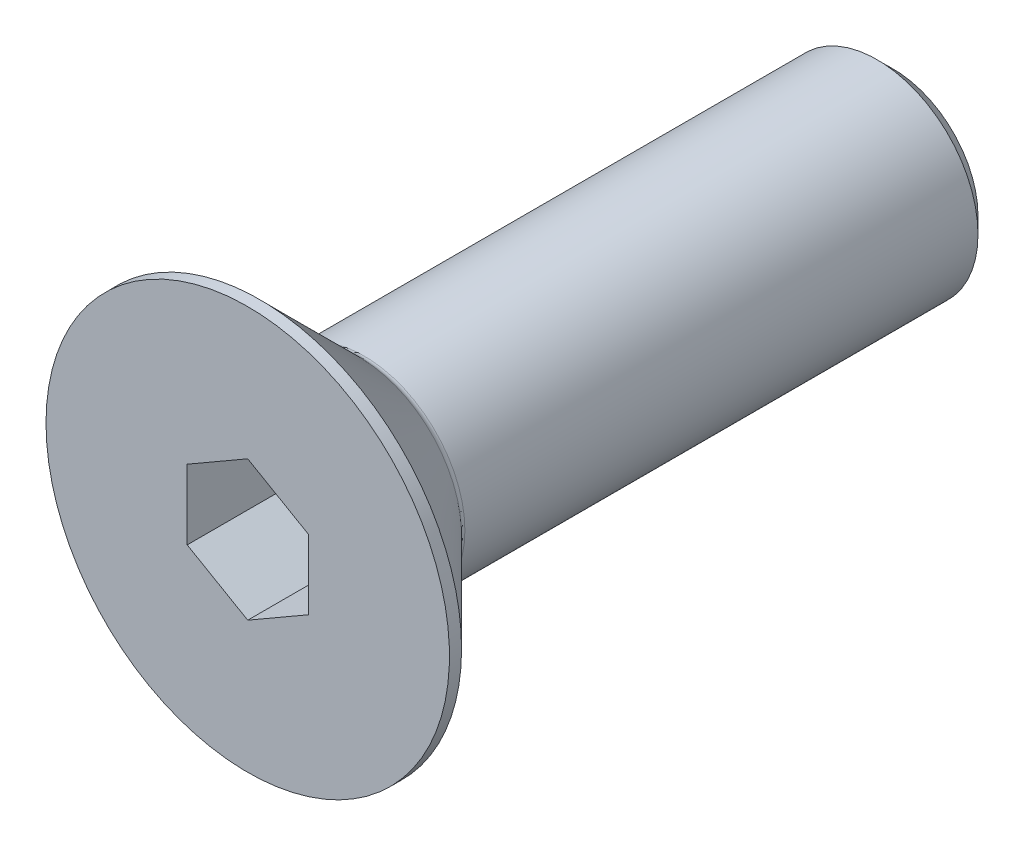
ISO-10303-21;
HEADER;
FILE_DESCRIPTION(('STEP AP214'),'2;1');
FILE_NAME('part.step','',(''),(''),'','','');
FILE_SCHEMA(('AUTOMOTIVE_DESIGN { 1 0 10303 214 1 1 1 1 }'));
ENDSEC;
DATA;
#1=APPLICATION_CONTEXT('core data for automotive mechanical design processes');
#2=APPLICATION_PROTOCOL_DEFINITION('international standard','automotive_design',2000,#1);
#3=PRODUCT_CONTEXT('',#1,'mechanical');
#4=PRODUCT('Part','Part','',(#3));
#5=PRODUCT_RELATED_PRODUCT_CATEGORY('part','',(#4));
#6=PRODUCT_DEFINITION_FORMATION('','',#4);
#7=PRODUCT_DEFINITION_CONTEXT('part definition',#1,'design');
#8=PRODUCT_DEFINITION('design','',#6,#7);
#9=PRODUCT_DEFINITION_SHAPE('','',#8);
#10=(LENGTH_UNIT() NAMED_UNIT(*) SI_UNIT(.MILLI.,.METRE.));
#11=(NAMED_UNIT(*) PLANE_ANGLE_UNIT() SI_UNIT($,.RADIAN.));
#12=(NAMED_UNIT(*) SI_UNIT($,.STERADIAN.) SOLID_ANGLE_UNIT());
#13=UNCERTAINTY_MEASURE_WITH_UNIT(LENGTH_MEASURE(1.E-05),#10,'distance_accuracy_value','');
#14=(GEOMETRIC_REPRESENTATION_CONTEXT(3) GLOBAL_UNCERTAINTY_ASSIGNED_CONTEXT((#13)) GLOBAL_UNIT_ASSIGNED_CONTEXT((#10,
#11,#12)) REPRESENTATION_CONTEXT('',''));
#15=CARTESIAN_POINT('',(0.,0.,0.));
#16=DIRECTION('',(0.,0.,1.));
#17=DIRECTION('',(1.,0.,0.));
#18=AXIS2_PLACEMENT_3D('',#15,#16,#17);
#19=CARTESIAN_POINT('',(0.,1.73205080756888,0.));
#20=DIRECTION('',(-0.5,0.866025403784439,0.));
#21=DIRECTION('',(-0.866025403784439,-0.5,0.));
#22=AXIS2_PLACEMENT_3D('',#19,#20,#21);
#23=PLANE('',#22);
#24=DIRECTION('',(0.,0.,1.));
#25=VECTOR('',#24,1.);
#26=CARTESIAN_POINT('',(0.,1.73205080756888,0.));
#27=LINE('',#26,#25);
#28=CARTESIAN_POINT('',(0.,1.73205080756888,-2.3));
#29=VERTEX_POINT('',#28);
#30=CARTESIAN_POINT('',(0.,1.73205080756888,0.));
#31=VERTEX_POINT('',#30);
#32=EDGE_CURVE('E81',#29,#31,#27,.T.);
#33=ORIENTED_EDGE('',*,*,#32,.T.);
#34=DIRECTION('',(-0.866025403784439,-0.5,0.));
#35=VECTOR('',#34,1.);
#36=CARTESIAN_POINT('',(0.,1.73205080756888,0.));
#37=LINE('',#36,#35);
#38=CARTESIAN_POINT('',(-1.5,0.866025403784439,0.));
#39=VERTEX_POINT('',#38);
#40=EDGE_CURVE('E70',#39,#31,#37,.F.);
#41=ORIENTED_EDGE('',*,*,#40,.F.);
#42=DIRECTION('',(0.,0.,1.));
#43=VECTOR('',#42,1.);
#44=CARTESIAN_POINT('',(-1.5,0.866025403784439,0.));
#45=LINE('',#44,#43);
#46=CARTESIAN_POINT('',(-1.5,0.866025403784439,-2.3));
#47=VERTEX_POINT('',#46);
#48=EDGE_CURVE('E137',#39,#47,#45,.F.);
#49=ORIENTED_EDGE('',*,*,#48,.T.);
#50=DIRECTION('',(-0.866025403784439,-0.5,0.));
#51=VECTOR('',#50,1.);
#52=CARTESIAN_POINT('',(0.,1.73205080756888,-2.3));
#53=LINE('',#52,#51);
#54=EDGE_CURVE('E66',#29,#47,#53,.T.);
#55=ORIENTED_EDGE('',*,*,#54,.F.);
#56=EDGE_LOOP('',(#33,#41,#49,#55));
#57=FACE_BOUND('',#56,.T.);
#58=ADVANCED_FACE('F15',(#57),#23,.F.);
#59=CARTESIAN_POINT('',(1.5,0.86602540378444,0.));
#60=DIRECTION('',(0.499999999999999,0.866025403784439,0.));
#61=DIRECTION('',(-0.866025403784439,0.499999999999999,0.));
#62=AXIS2_PLACEMENT_3D('',#59,#60,#61);
#63=PLANE('',#62);
#64=DIRECTION('',(0.,0.,-1.));
#65=VECTOR('',#64,1.);
#66=CARTESIAN_POINT('',(1.5,0.86602540378444,0.));
#67=LINE('',#66,#65);
#68=CARTESIAN_POINT('',(1.5,0.86602540378444,-2.3));
#69=VERTEX_POINT('',#68);
#70=CARTESIAN_POINT('',(1.5,0.86602540378444,0.));
#71=VERTEX_POINT('',#70);
#72=EDGE_CURVE('E86',#69,#71,#67,.F.);
#73=ORIENTED_EDGE('',*,*,#72,.T.);
#74=DIRECTION('',(-0.866025403784439,0.499999999999999,0.));
#75=VECTOR('',#74,1.);
#76=CARTESIAN_POINT('',(1.5,0.86602540378444,0.));
#77=LINE('',#76,#75);
#78=EDGE_CURVE('E74',#31,#71,#77,.F.);
#79=ORIENTED_EDGE('',*,*,#78,.F.);
#80=ORIENTED_EDGE('',*,*,#32,.F.);
#81=DIRECTION('',(-0.866025403784439,0.499999999999999,0.));
#82=VECTOR('',#81,1.);
#83=CARTESIAN_POINT('',(1.5,0.86602540378444,-2.3));
#84=LINE('',#83,#82);
#85=EDGE_CURVE('E87',#69,#29,#84,.T.);
#86=ORIENTED_EDGE('',*,*,#85,.F.);
#87=EDGE_LOOP('',(#73,#79,#80,#86));
#88=FACE_BOUND('',#87,.T.);
#89=ADVANCED_FACE('F84',(#88),#63,.F.);
#90=CARTESIAN_POINT('',(-1.5,0.866025403784439,0.));
#91=DIRECTION('',(-1.,0.,0.));
#92=DIRECTION('',(0.,0.,1.));
#93=AXIS2_PLACEMENT_3D('',#90,#91,#92);
#94=PLANE('',#93);
#95=ORIENTED_EDGE('',*,*,#48,.F.);
#96=DIRECTION('',(0.,1.,0.));
#97=VECTOR('',#96,1.);
#98=CARTESIAN_POINT('',(-1.5,0.866025403784439,0.));
#99=LINE('',#98,#97);
#100=CARTESIAN_POINT('',(-1.5,-0.866025403784439,0.));
#101=VERTEX_POINT('',#100);
#102=EDGE_CURVE('E77',#101,#39,#99,.T.);
#103=ORIENTED_EDGE('',*,*,#102,.F.);
#104=DIRECTION('',(0.,0.,1.));
#105=VECTOR('',#104,1.);
#106=CARTESIAN_POINT('',(-1.5,-0.866025403784439,0.));
#107=LINE('',#106,#105);
#108=CARTESIAN_POINT('',(-1.5,-0.866025403784439,-2.3));
#109=VERTEX_POINT('',#108);
#110=EDGE_CURVE('E128',#101,#109,#107,.F.);
#111=ORIENTED_EDGE('',*,*,#110,.T.);
#112=DIRECTION('',(0.,1.,0.));
#113=VECTOR('',#112,1.);
#114=CARTESIAN_POINT('',(-1.5,0.866025403784439,-2.3));
#115=LINE('',#114,#113);
#116=EDGE_CURVE('E135',#47,#109,#115,.F.);
#117=ORIENTED_EDGE('',*,*,#116,.F.);
#118=EDGE_LOOP('',(#95,#103,#111,#117));
#119=FACE_BOUND('',#118,.T.);
#120=ADVANCED_FACE('F140',(#119),#94,.F.);
#121=CARTESIAN_POINT('',(1.5,-0.866025403784439,0.));
#122=DIRECTION('',(1.,0.,0.));
#123=DIRECTION('',(0.,0.,-1.));
#124=AXIS2_PLACEMENT_3D('',#121,#122,#123);
#125=PLANE('',#124);
#126=DIRECTION('',(0.,0.,1.));
#127=VECTOR('',#126,1.);
#128=CARTESIAN_POINT('',(1.5,-0.866025403784439,0.));
#129=LINE('',#128,#127);
#130=CARTESIAN_POINT('',(1.5,-0.866025403784439,-2.3));
#131=VERTEX_POINT('',#130);
#132=CARTESIAN_POINT('',(1.5,-0.866025403784439,0.));
#133=VERTEX_POINT('',#132);
#134=EDGE_CURVE('E120',#131,#133,#129,.T.);
#135=ORIENTED_EDGE('',*,*,#134,.T.);
#136=DIRECTION('',(0.,1.,0.));
#137=VECTOR('',#136,1.);
#138=CARTESIAN_POINT('',(1.5,-0.866025403784439,0.));
#139=LINE('',#138,#137);
#140=EDGE_CURVE('E34',#71,#133,#139,.F.);
#141=ORIENTED_EDGE('',*,*,#140,.F.);
#142=ORIENTED_EDGE('',*,*,#72,.F.);
#143=DIRECTION('',(0.,1.,0.));
#144=VECTOR('',#143,1.);
#145=CARTESIAN_POINT('',(1.5,0.,-2.3));
#146=LINE('',#145,#144);
#147=EDGE_CURVE('E122',#131,#69,#146,.T.);
#148=ORIENTED_EDGE('',*,*,#147,.F.);
#149=EDGE_LOOP('',(#135,#141,#142,#148));
#150=FACE_BOUND('',#149,.T.);
#151=ADVANCED_FACE('F147',(#150),#125,.F.);
#152=CARTESIAN_POINT('',(-1.5,-0.866025403784439,0.));
#153=DIRECTION('',(-0.499999999999999,-0.866025403784439,0.));
#154=DIRECTION('',(0.866025403784439,-0.499999999999999,0.));
#155=AXIS2_PLACEMENT_3D('',#152,#153,#154);
#156=PLANE('',#155);
#157=ORIENTED_EDGE('',*,*,#110,.F.);
#158=DIRECTION('',(0.866025403784439,-0.499999999999999,0.));
#159=VECTOR('',#158,1.);
#160=CARTESIAN_POINT('',(-1.5,-0.866025403784439,0.));
#161=LINE('',#160,#159);
#162=CARTESIAN_POINT('',(0.,-1.73205080756888,0.));
#163=VERTEX_POINT('',#162);
#164=EDGE_CURVE('E131',#163,#101,#161,.F.);
#165=ORIENTED_EDGE('',*,*,#164,.F.);
#166=DIRECTION('',(0.,0.,1.));
#167=VECTOR('',#166,1.);
#168=CARTESIAN_POINT('',(0.,-1.73205080756888,0.));
#169=LINE('',#168,#167);
#170=CARTESIAN_POINT('',(0.,-1.73205080756888,-2.3));
#171=VERTEX_POINT('',#170);
#172=EDGE_CURVE('E118',#163,#171,#169,.F.);
#173=ORIENTED_EDGE('',*,*,#172,.T.);
#174=DIRECTION('',(0.866025403784439,-0.5,0.));
#175=VECTOR('',#174,1.);
#176=CARTESIAN_POINT('',(-1.5,-0.866025403784439,-2.3));
#177=LINE('',#176,#175);
#178=EDGE_CURVE('E125',#109,#171,#177,.T.);
#179=ORIENTED_EDGE('',*,*,#178,.F.);
#180=EDGE_LOOP('',(#157,#165,#173,#179));
#181=FACE_BOUND('',#180,.T.);
#182=ADVANCED_FACE('F154',(#181),#156,.F.);
#183=CARTESIAN_POINT('',(0.,0.,-2.3));
#184=DIRECTION('',(0.,0.,1.));
#185=DIRECTION('',(1.,0.,0.));
#186=AXIS2_PLACEMENT_3D('',#183,#184,#185);
#187=PLANE('',#186);
#188=ORIENTED_EDGE('',*,*,#54,.T.);
#189=ORIENTED_EDGE('',*,*,#116,.T.);
#190=ORIENTED_EDGE('',*,*,#178,.T.);
#191=DIRECTION('',(0.866025403784439,0.5,0.));
#192=VECTOR('',#191,1.);
#193=CARTESIAN_POINT('',(0.,-1.73205080756888,-2.3));
#194=LINE('',#193,#192);
#195=EDGE_CURVE('E115',#171,#131,#194,.T.);
#196=ORIENTED_EDGE('',*,*,#195,.T.);
#197=ORIENTED_EDGE('',*,*,#147,.T.);
#198=ORIENTED_EDGE('',*,*,#85,.T.);
#199=EDGE_LOOP('',(#188,#189,#190,#196,#197,#198));
#200=FACE_BOUND('',#199,.T.);
#201=ADVANCED_FACE('F144',(#200),#187,.T.);
#202=CARTESIAN_POINT('',(0.,-1.73205080756888,0.));
#203=DIRECTION('',(0.5,-0.866025403784439,0.));
#204=DIRECTION('',(0.866025403784439,0.5,0.));
#205=AXIS2_PLACEMENT_3D('',#202,#203,#204);
#206=PLANE('',#205);
#207=ORIENTED_EDGE('',*,*,#172,.F.);
#208=DIRECTION('',(-0.866025403784439,-0.5,0.));
#209=VECTOR('',#208,1.);
#210=CARTESIAN_POINT('',(1.5,-0.866025403784439,0.));
#211=LINE('',#210,#209);
#212=EDGE_CURVE('E113',#133,#163,#211,.T.);
#213=ORIENTED_EDGE('',*,*,#212,.F.);
#214=ORIENTED_EDGE('',*,*,#134,.F.);
#215=ORIENTED_EDGE('',*,*,#195,.F.);
#216=EDGE_LOOP('',(#207,#213,#214,#215));
#217=FACE_BOUND('',#216,.T.);
#218=ADVANCED_FACE('F152',(#217),#206,.F.);
#219=CARTESIAN_POINT('',(2.5,0.,0.));
#220=DIRECTION('',(0.,0.,1.));
#221=DIRECTION('',(1.,0.,0.));
#222=AXIS2_PLACEMENT_3D('',#219,#220,#221);
#223=PLANE('',#222);
#224=ORIENTED_EDGE('',*,*,#140,.T.);
#225=ORIENTED_EDGE('',*,*,#212,.T.);
#226=ORIENTED_EDGE('',*,*,#164,.T.);
#227=ORIENTED_EDGE('',*,*,#102,.T.);
#228=ORIENTED_EDGE('',*,*,#40,.T.);
#229=ORIENTED_EDGE('',*,*,#78,.T.);
#230=EDGE_LOOP('',(#224,#225,#226,#227,#228,#229));
#231=FACE_BOUND('',#230,.T.);
#232=CARTESIAN_POINT('',(0.,0.,0.));
#233=DIRECTION('',(0.,0.,-1.));
#234=DIRECTION('',(-1.,0.,0.));
#235=AXIS2_PLACEMENT_3D('',#232,#233,#234);
#236=CIRCLE('',#235,5.);
#237=CARTESIAN_POINT('',(-5.,0.,0.));
#238=VERTEX_POINT('',#237);
#239=EDGE_CURVE('E19',#238,#238,#236,.T.);
#240=ORIENTED_EDGE('',*,*,#239,.F.);
#241=EDGE_LOOP('',(#240));
#242=FACE_BOUND('',#241,.T.);
#243=ADVANCED_FACE('F71',(#231,#242),#223,.T.);
#244=CARTESIAN_POINT('',(0.,0.,-0.150000000000001));
#245=DIRECTION('',(0.,0.,-1.));
#246=DIRECTION('',(-1.,0.,0.));
#247=AXIS2_PLACEMENT_3D('',#244,#245,#246);
#248=CYLINDRICAL_SURFACE('',#247,5.);
#249=ORIENTED_EDGE('',*,*,#239,.T.);
#250=EDGE_LOOP('',(#249));
#251=FACE_BOUND('',#250,.T.);
#252=CARTESIAN_POINT('',(0.,0.,-0.299999998844669));
#253=DIRECTION('',(0.,0.,1.));
#254=DIRECTION('',(1.,0.,0.));
#255=AXIS2_PLACEMENT_3D('',#252,#253,#254);
#256=CIRCLE('',#255,4.99999999891543);
#257=CARTESIAN_POINT('',(4.99999999891543,0.,-0.299999998844669));
#258=VERTEX_POINT('',#257);
#259=EDGE_CURVE('E100',#258,#258,#256,.F.);
#260=ORIENTED_EDGE('',*,*,#259,.F.);
#261=EDGE_LOOP('',(#260));
#262=FACE_BOUND('',#261,.T.);
#263=ADVANCED_FACE('F183',(#251,#262),#248,.T.);
#264=CARTESIAN_POINT('',(0.,0.,-0.299999998844669));
#265=DIRECTION('',(0.,0.,1.));
#266=DIRECTION('',(1.,0.,0.));
#267=AXIS2_PLACEMENT_3D('',#264,#265,#266);
#268=CONICAL_SURFACE('',#267,4.99999999891543,0.785398162501056);
#269=CARTESIAN_POINT('',(0.,0.,-2.74142135623731));
#270=DIRECTION('',(0.,0.,-1.));
#271=DIRECTION('',(-1.,0.,0.));
#272=AXIS2_PLACEMENT_3D('',#269,#270,#271);
#273=CIRCLE('',#272,2.55857864376269);
#274=CARTESIAN_POINT('',(-2.55857864376269,0.,-2.74142135623731));
#275=VERTEX_POINT('',#274);
#276=EDGE_CURVE('E94',#275,#275,#273,.T.);
#277=ORIENTED_EDGE('',*,*,#276,.F.);
#278=EDGE_LOOP('',(#277));
#279=FACE_BOUND('',#278,.T.);
#280=ORIENTED_EDGE('',*,*,#259,.T.);
#281=EDGE_LOOP('',(#280));
#282=FACE_BOUND('',#281,.T.);
#283=ADVANCED_FACE('F179',(#279,#282),#268,.T.);
#284=CARTESIAN_POINT('',(1.25,0.,-16.));
#285=DIRECTION('',(0.,0.,-1.));
#286=DIRECTION('',(-1.,0.,0.));
#287=AXIS2_PLACEMENT_3D('',#284,#285,#286);
#288=PLANE('',#287);
#289=CARTESIAN_POINT('',(0.,0.,-16.0000000001901));
#290=DIRECTION('',(0.,0.,1.));
#291=DIRECTION('',(1.,0.,0.));
#292=AXIS2_PLACEMENT_3D('',#289,#290,#291);
#293=CIRCLE('',#292,2.10000000015498);
#294=CARTESIAN_POINT('',(2.10000000015498,0.,-16.0000000001901));
#295=VERTEX_POINT('',#294);
#296=EDGE_CURVE('E92',#295,#295,#293,.T.);
#297=ORIENTED_EDGE('',*,*,#296,.F.);
#298=EDGE_LOOP('',(#297));
#299=FACE_BOUND('',#298,.T.);
#300=ADVANCED_FACE('F176',(#299),#288,.T.);
#301=CARTESIAN_POINT('',(0.,0.,-2.88284271247462));
#302=DIRECTION('',(0.,0.,-1.));
#303=DIRECTION('',(0.,1.,0.));
#304=AXIS2_PLACEMENT_3D('',#301,#302,#303);
#305=TOROIDAL_SURFACE('',#304,2.7,0.2);
#306=CARTESIAN_POINT('',(0.,0.,-2.88284271247462));
#307=DIRECTION('',(0.,0.,-1.));
#308=DIRECTION('',(-1.,0.,0.));
#309=AXIS2_PLACEMENT_3D('',#306,#307,#308);
#310=CIRCLE('',#309,2.5);
#311=CARTESIAN_POINT('',(-2.5,0.,-2.88284271247462));
#312=VERTEX_POINT('',#311);
#313=EDGE_CURVE('E25',#312,#312,#310,.T.);
#314=ORIENTED_EDGE('',*,*,#313,.F.);
#315=EDGE_LOOP('',(#314));
#316=FACE_BOUND('',#315,.T.);
#317=ORIENTED_EDGE('',*,*,#276,.T.);
#318=EDGE_LOOP('',(#317));
#319=FACE_BOUND('',#318,.T.);
#320=ADVANCED_FACE('F17',(#316,#319),#305,.F.);
#321=CARTESIAN_POINT('',(0.,0.,-15.5999999998357));
#322=DIRECTION('',(0.,0.,1.));
#323=DIRECTION('',(1.,0.,0.));
#324=AXIS2_PLACEMENT_3D('',#321,#322,#323);
#325=CONICAL_SURFACE('',#324,2.4999999998272,0.785398162544797);
#326=ORIENTED_EDGE('',*,*,#296,.T.);
#327=EDGE_LOOP('',(#326));
#328=FACE_BOUND('',#327,.T.);
#329=CARTESIAN_POINT('',(0.,0.,-15.6));
#330=DIRECTION('',(0.,0.,-1.));
#331=DIRECTION('',(-1.,0.,0.));
#332=AXIS2_PLACEMENT_3D('',#329,#330,#331);
#333=CIRCLE('',#332,2.5);
#334=CARTESIAN_POINT('',(-2.5,0.,-15.6));
#335=VERTEX_POINT('',#334);
#336=EDGE_CURVE('E10',#335,#335,#333,.F.);
#337=ORIENTED_EDGE('',*,*,#336,.F.);
#338=EDGE_LOOP('',(#337));
#339=FACE_BOUND('',#338,.T.);
#340=ADVANCED_FACE('F166',(#328,#339),#325,.T.);
#341=CARTESIAN_POINT('',(0.,0.,-9.4));
#342=DIRECTION('',(0.,0.,-1.));
#343=DIRECTION('',(-1.,0.,0.));
#344=AXIS2_PLACEMENT_3D('',#341,#342,#343);
#345=CYLINDRICAL_SURFACE('',#344,2.5);
#346=ORIENTED_EDGE('',*,*,#336,.T.);
#347=EDGE_LOOP('',(#346));
#348=FACE_BOUND('',#347,.T.);
#349=ORIENTED_EDGE('',*,*,#313,.T.);
#350=EDGE_LOOP('',(#349));
#351=FACE_BOUND('',#350,.T.);
#352=ADVANCED_FACE('F164',(#348,#351),#345,.T.);
#353=CLOSED_SHELL('',(#58,#89,#120,#151,#182,#201,#218,#243,#263,#283,#300,#320,#340,#352));
#354=MANIFOLD_SOLID_BREP('B1',#353);
#355=ADVANCED_BREP_SHAPE_REPRESENTATION('',(#18,#354),#14);
#356=SHAPE_DEFINITION_REPRESENTATION(#9,#355);
ENDSEC;
END-ISO-10303-21;
